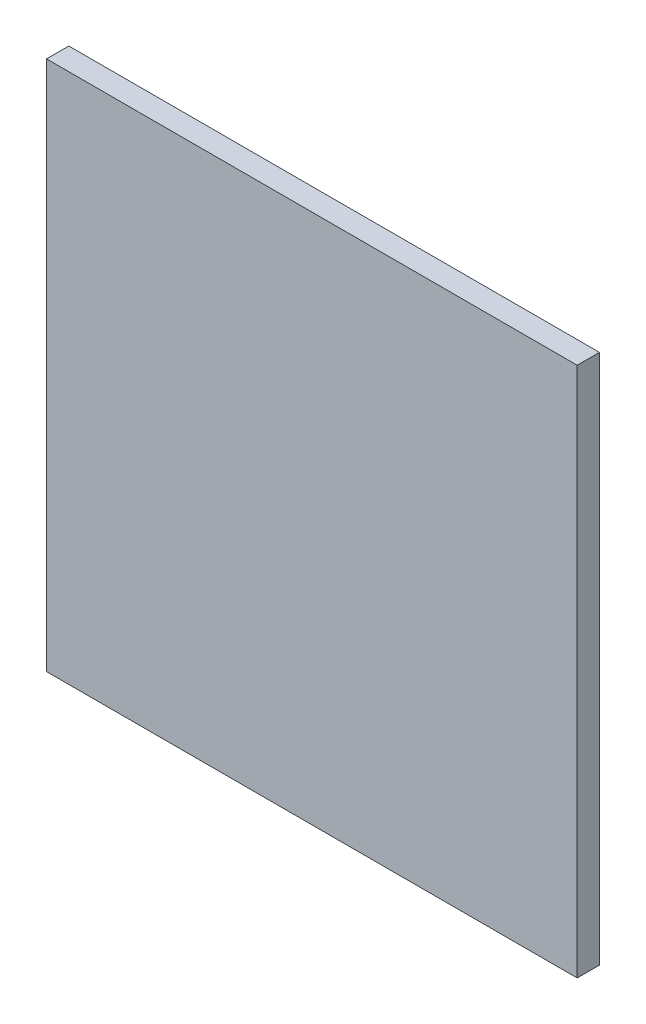
ISO-10303-21;
HEADER;
FILE_DESCRIPTION(('STEP AP214'),'2;1');
FILE_NAME('part.step','',(''),(''),'','','');
FILE_SCHEMA(('AUTOMOTIVE_DESIGN { 1 0 10303 214 1 1 1 1 }'));
ENDSEC;
DATA;
#1=APPLICATION_CONTEXT('core data for automotive mechanical design processes');
#2=APPLICATION_PROTOCOL_DEFINITION('international standard','automotive_design',2000,#1);
#3=PRODUCT_CONTEXT('',#1,'mechanical');
#4=PRODUCT('Part','Part','',(#3));
#5=PRODUCT_RELATED_PRODUCT_CATEGORY('part','',(#4));
#6=PRODUCT_DEFINITION_FORMATION('','',#4);
#7=PRODUCT_DEFINITION_CONTEXT('part definition',#1,'design');
#8=PRODUCT_DEFINITION('design','',#6,#7);
#9=PRODUCT_DEFINITION_SHAPE('','',#8);
#10=(LENGTH_UNIT() NAMED_UNIT(*) SI_UNIT(.MILLI.,.METRE.));
#11=(NAMED_UNIT(*) PLANE_ANGLE_UNIT() SI_UNIT($,.RADIAN.));
#12=(NAMED_UNIT(*) SI_UNIT($,.STERADIAN.) SOLID_ANGLE_UNIT());
#13=UNCERTAINTY_MEASURE_WITH_UNIT(LENGTH_MEASURE(1.E-05),#10,'distance_accuracy_value','');
#14=(GEOMETRIC_REPRESENTATION_CONTEXT(3) GLOBAL_UNCERTAINTY_ASSIGNED_CONTEXT((#13)) GLOBAL_UNIT_ASSIGNED_CONTEXT((#10,
#11,#12)) REPRESENTATION_CONTEXT('',''));
#15=CARTESIAN_POINT('',(0.,0.,0.));
#16=DIRECTION('',(0.,0.,1.));
#17=DIRECTION('',(1.,0.,0.));
#18=AXIS2_PLACEMENT_3D('',#15,#16,#17);
#19=CARTESIAN_POINT('',(0.,0.,3.));
#20=DIRECTION('',(1.,0.,0.));
#21=DIRECTION('',(0.,0.,-1.));
#22=AXIS2_PLACEMENT_3D('',#19,#20,#21);
#23=PLANE('',#22);
#24=DIRECTION('',(0.,-1.,0.));
#25=VECTOR('',#24,1.);
#26=CARTESIAN_POINT('',(0.,0.,0.));
#27=LINE('',#26,#25);
#28=CARTESIAN_POINT('',(0.,71.5,0.));
#29=VERTEX_POINT('',#28);
#30=CARTESIAN_POINT('',(0.,0.,0.));
#31=VERTEX_POINT('',#30);
#32=EDGE_CURVE('E96',#29,#31,#27,.T.);
#33=ORIENTED_EDGE('',*,*,#32,.T.);
#34=DIRECTION('',(0.,0.,-1.));
#35=VECTOR('',#34,1.);
#36=CARTESIAN_POINT('',(0.,0.,3.));
#37=LINE('',#36,#35);
#38=CARTESIAN_POINT('',(0.,0.,3.));
#39=VERTEX_POINT('',#38);
#40=EDGE_CURVE('E11',#39,#31,#37,.T.);
#41=ORIENTED_EDGE('',*,*,#40,.F.);
#42=DIRECTION('',(0.,-1.,0.));
#43=VECTOR('',#42,1.);
#44=CARTESIAN_POINT('',(0.,0.,3.));
#45=LINE('',#44,#43);
#46=CARTESIAN_POINT('',(0.,71.5,3.));
#47=VERTEX_POINT('',#46);
#48=EDGE_CURVE('E84',#47,#39,#45,.T.);
#49=ORIENTED_EDGE('',*,*,#48,.F.);
#50=DIRECTION('',(0.,0.,-1.));
#51=VECTOR('',#50,1.);
#52=CARTESIAN_POINT('',(0.,71.5,3.));
#53=LINE('',#52,#51);
#54=EDGE_CURVE('E92',#47,#29,#53,.T.);
#55=ORIENTED_EDGE('',*,*,#54,.T.);
#56=EDGE_LOOP('',(#33,#41,#49,#55));
#57=FACE_BOUND('',#56,.T.);
#58=ADVANCED_FACE('F33',(#57),#23,.F.);
#59=CARTESIAN_POINT('',(0.,0.,3.));
#60=DIRECTION('',(0.,1.,0.));
#61=DIRECTION('',(0.,0.,1.));
#62=AXIS2_PLACEMENT_3D('',#59,#60,#61);
#63=PLANE('',#62);
#64=DIRECTION('',(1.,0.,0.));
#65=VECTOR('',#64,1.);
#66=CARTESIAN_POINT('',(0.,0.,0.));
#67=LINE('',#66,#65);
#68=CARTESIAN_POINT('',(71.5,0.,0.));
#69=VERTEX_POINT('',#68);
#70=EDGE_CURVE('E88',#31,#69,#67,.T.);
#71=ORIENTED_EDGE('',*,*,#70,.T.);
#72=DIRECTION('',(0.,0.,-1.));
#73=VECTOR('',#72,1.);
#74=CARTESIAN_POINT('',(71.5,0.,3.));
#75=LINE('',#74,#73);
#76=CARTESIAN_POINT('',(71.5,0.,3.));
#77=VERTEX_POINT('',#76);
#78=EDGE_CURVE('E41',#77,#69,#75,.T.);
#79=ORIENTED_EDGE('',*,*,#78,.F.);
#80=DIRECTION('',(1.,0.,0.));
#81=VECTOR('',#80,1.);
#82=CARTESIAN_POINT('',(0.,0.,3.));
#83=LINE('',#82,#81);
#84=EDGE_CURVE('E79',#39,#77,#83,.T.);
#85=ORIENTED_EDGE('',*,*,#84,.F.);
#86=ORIENTED_EDGE('',*,*,#40,.T.);
#87=EDGE_LOOP('',(#71,#79,#85,#86));
#88=FACE_BOUND('',#87,.T.);
#89=ADVANCED_FACE('F87',(#88),#63,.F.);
#90=CARTESIAN_POINT('',(71.5,0.,3.));
#91=DIRECTION('',(-1.,0.,0.));
#92=DIRECTION('',(0.,0.,1.));
#93=AXIS2_PLACEMENT_3D('',#90,#91,#92);
#94=PLANE('',#93);
#95=DIRECTION('',(0.,1.,0.));
#96=VECTOR('',#95,1.);
#97=CARTESIAN_POINT('',(71.5,0.,0.));
#98=LINE('',#97,#96);
#99=CARTESIAN_POINT('',(71.5,71.5,0.));
#100=VERTEX_POINT('',#99);
#101=EDGE_CURVE('E66',#69,#100,#98,.T.);
#102=ORIENTED_EDGE('',*,*,#101,.T.);
#103=DIRECTION('',(0.,0.,-1.));
#104=VECTOR('',#103,1.);
#105=CARTESIAN_POINT('',(71.5,71.5,3.));
#106=LINE('',#105,#104);
#107=CARTESIAN_POINT('',(71.5,71.5,3.));
#108=VERTEX_POINT('',#107);
#109=EDGE_CURVE('E89',#108,#100,#106,.T.);
#110=ORIENTED_EDGE('',*,*,#109,.F.);
#111=DIRECTION('',(0.,1.,0.));
#112=VECTOR('',#111,1.);
#113=CARTESIAN_POINT('',(71.5,0.,3.));
#114=LINE('',#113,#112);
#115=EDGE_CURVE('E82',#77,#108,#114,.T.);
#116=ORIENTED_EDGE('',*,*,#115,.F.);
#117=ORIENTED_EDGE('',*,*,#78,.T.);
#118=EDGE_LOOP('',(#102,#110,#116,#117));
#119=FACE_BOUND('',#118,.T.);
#120=ADVANCED_FACE('F90',(#119),#94,.F.);
#121=CARTESIAN_POINT('',(0.,71.5,3.));
#122=DIRECTION('',(0.,-1.,0.));
#123=DIRECTION('',(0.,0.,-1.));
#124=AXIS2_PLACEMENT_3D('',#121,#122,#123);
#125=PLANE('',#124);
#126=DIRECTION('',(-1.,0.,0.));
#127=VECTOR('',#126,1.);
#128=CARTESIAN_POINT('',(0.,71.5,0.));
#129=LINE('',#128,#127);
#130=EDGE_CURVE('E72',#100,#29,#129,.T.);
#131=ORIENTED_EDGE('',*,*,#130,.T.);
#132=ORIENTED_EDGE('',*,*,#54,.F.);
#133=DIRECTION('',(-1.,0.,0.));
#134=VECTOR('',#133,1.);
#135=CARTESIAN_POINT('',(0.,71.5,3.));
#136=LINE('',#135,#134);
#137=EDGE_CURVE('E49',#108,#47,#136,.T.);
#138=ORIENTED_EDGE('',*,*,#137,.F.);
#139=ORIENTED_EDGE('',*,*,#109,.T.);
#140=EDGE_LOOP('',(#131,#132,#138,#139));
#141=FACE_BOUND('',#140,.T.);
#142=ADVANCED_FACE('F103',(#141),#125,.F.);
#143=CARTESIAN_POINT('',(0.,0.,3.));
#144=DIRECTION('',(0.,0.,-1.));
#145=DIRECTION('',(-1.,0.,0.));
#146=AXIS2_PLACEMENT_3D('',#143,#144,#145);
#147=PLANE('',#146);
#148=ORIENTED_EDGE('',*,*,#48,.T.);
#149=ORIENTED_EDGE('',*,*,#84,.T.);
#150=ORIENTED_EDGE('',*,*,#115,.T.);
#151=ORIENTED_EDGE('',*,*,#137,.T.);
#152=EDGE_LOOP('',(#148,#149,#150,#151));
#153=FACE_BOUND('',#152,.T.);
#154=ADVANCED_FACE('F80',(#153),#147,.F.);
#155=CARTESIAN_POINT('',(0.,0.,0.));
#156=DIRECTION('',(0.,0.,-1.));
#157=DIRECTION('',(-1.,0.,0.));
#158=AXIS2_PLACEMENT_3D('',#155,#156,#157);
#159=PLANE('',#158);
#160=ORIENTED_EDGE('',*,*,#32,.F.);
#161=ORIENTED_EDGE('',*,*,#130,.F.);
#162=ORIENTED_EDGE('',*,*,#101,.F.);
#163=ORIENTED_EDGE('',*,*,#70,.F.);
#164=EDGE_LOOP('',(#160,#161,#162,#163));
#165=FACE_BOUND('',#164,.T.);
#166=ADVANCED_FACE('F106',(#165),#159,.T.);
#167=CLOSED_SHELL('',(#58,#89,#120,#142,#154,#166));
#168=MANIFOLD_SOLID_BREP('B2',#167);
#169=ADVANCED_BREP_SHAPE_REPRESENTATION('',(#18,#168),#14);
#170=SHAPE_DEFINITION_REPRESENTATION(#9,#169);
ENDSEC;
END-ISO-10303-21;
